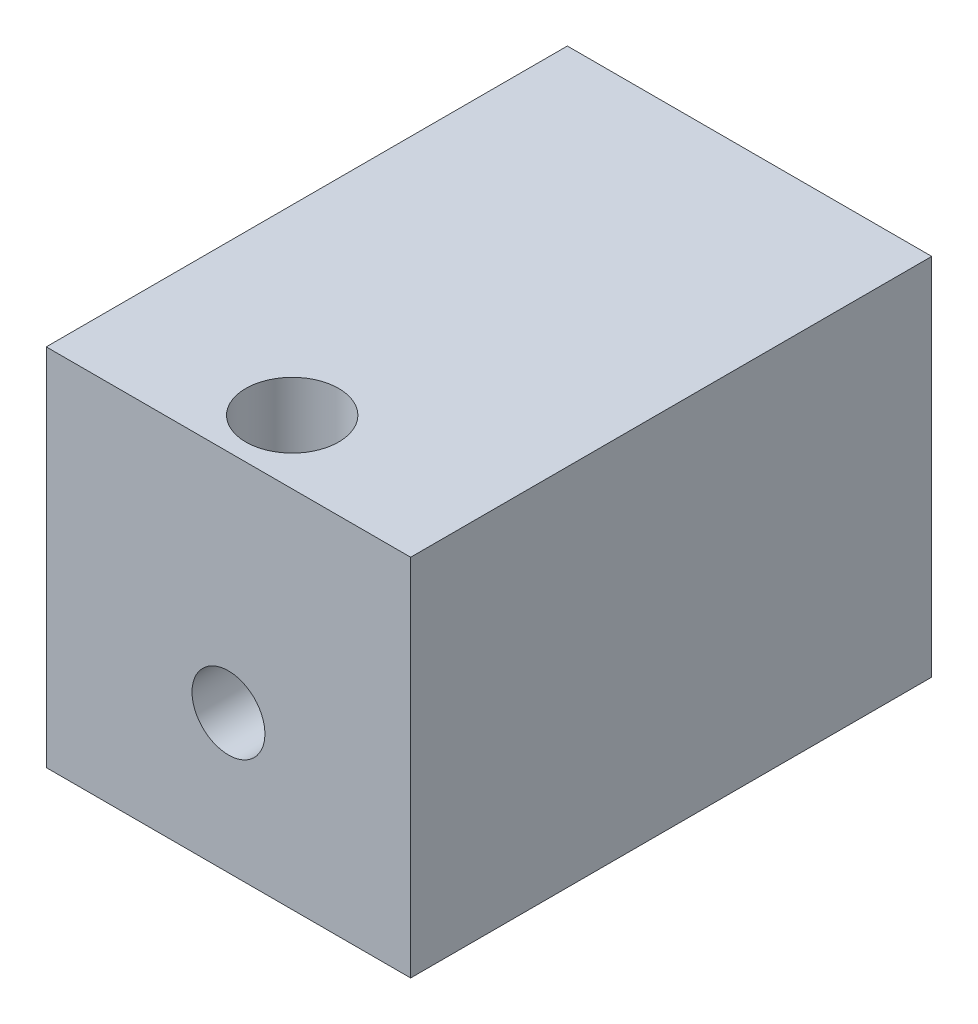
ISO-10303-21;
HEADER;
FILE_DESCRIPTION(('STEP AP214'),'2;1');
FILE_NAME('part.step','',(''),(''),'','','');
FILE_SCHEMA(('AUTOMOTIVE_DESIGN { 1 0 10303 214 1 1 1 1 }'));
ENDSEC;
DATA;
#1=APPLICATION_CONTEXT('core data for automotive mechanical design processes');
#2=APPLICATION_PROTOCOL_DEFINITION('international standard','automotive_design',2000,#1);
#3=PRODUCT_CONTEXT('',#1,'mechanical');
#4=PRODUCT('Part','Part','',(#3));
#5=PRODUCT_RELATED_PRODUCT_CATEGORY('part','',(#4));
#6=PRODUCT_DEFINITION_FORMATION('','',#4);
#7=PRODUCT_DEFINITION_CONTEXT('part definition',#1,'design');
#8=PRODUCT_DEFINITION('design','',#6,#7);
#9=PRODUCT_DEFINITION_SHAPE('','',#8);
#10=(LENGTH_UNIT() NAMED_UNIT(*) SI_UNIT(.MILLI.,.METRE.));
#11=(NAMED_UNIT(*) PLANE_ANGLE_UNIT() SI_UNIT($,.RADIAN.));
#12=(NAMED_UNIT(*) SI_UNIT($,.STERADIAN.) SOLID_ANGLE_UNIT());
#13=UNCERTAINTY_MEASURE_WITH_UNIT(LENGTH_MEASURE(1.E-05),#10,'distance_accuracy_value','');
#14=(GEOMETRIC_REPRESENTATION_CONTEXT(3) GLOBAL_UNCERTAINTY_ASSIGNED_CONTEXT((#13)) GLOBAL_UNIT_ASSIGNED_CONTEXT((#10,
#11,#12)) REPRESENTATION_CONTEXT('',''));
#15=CARTESIAN_POINT('',(0.,0.,0.));
#16=DIRECTION('',(0.,0.,1.));
#17=DIRECTION('',(1.,0.,0.));
#18=AXIS2_PLACEMENT_3D('',#15,#16,#17);
#19=CARTESIAN_POINT('',(0.,20.,0.));
#20=DIRECTION('',(1.,0.,0.));
#21=DIRECTION('',(0.,0.,-1.));
#22=AXIS2_PLACEMENT_3D('',#19,#20,#21);
#23=PLANE('',#22);
#24=DIRECTION('',(0.,0.,1.));
#25=VECTOR('',#24,1.);
#26=CARTESIAN_POINT('',(0.,0.,0.));
#27=LINE('',#26,#25);
#28=CARTESIAN_POINT('',(0.,0.,-28.6));
#29=VERTEX_POINT('',#28);
#30=CARTESIAN_POINT('',(0.,0.,0.));
#31=VERTEX_POINT('',#30);
#32=EDGE_CURVE('E104',#29,#31,#27,.T.);
#33=ORIENTED_EDGE('',*,*,#32,.T.);
#34=DIRECTION('',(0.,-1.,0.));
#35=VECTOR('',#34,1.);
#36=CARTESIAN_POINT('',(0.,20.,0.));
#37=LINE('',#36,#35);
#38=CARTESIAN_POINT('',(0.,20.,0.));
#39=VERTEX_POINT('',#38);
#40=EDGE_CURVE('E11',#39,#31,#37,.T.);
#41=ORIENTED_EDGE('',*,*,#40,.F.);
#42=DIRECTION('',(0.,0.,1.));
#43=VECTOR('',#42,1.);
#44=CARTESIAN_POINT('',(0.,20.,0.));
#45=LINE('',#44,#43);
#46=CARTESIAN_POINT('',(0.,20.,-28.6));
#47=VERTEX_POINT('',#46);
#48=EDGE_CURVE('E91',#47,#39,#45,.T.);
#49=ORIENTED_EDGE('',*,*,#48,.F.);
#50=DIRECTION('',(0.,-1.,0.));
#51=VECTOR('',#50,1.);
#52=CARTESIAN_POINT('',(0.,20.,-28.6));
#53=LINE('',#52,#51);
#54=EDGE_CURVE('E100',#47,#29,#53,.T.);
#55=ORIENTED_EDGE('',*,*,#54,.T.);
#56=EDGE_LOOP('',(#33,#41,#49,#55));
#57=FACE_BOUND('',#56,.T.);
#58=ADVANCED_FACE('F33',(#57),#23,.F.);
#59=CARTESIAN_POINT('',(0.,20.,0.));
#60=DIRECTION('',(0.,0.,-1.));
#61=DIRECTION('',(-1.,0.,0.));
#62=AXIS2_PLACEMENT_3D('',#59,#60,#61);
#63=PLANE('',#62);
#64=CARTESIAN_POINT('',(10.,7.6,0.));
#65=DIRECTION('',(0.,0.,-1.));
#66=DIRECTION('',(-1.,0.,0.));
#67=AXIS2_PLACEMENT_3D('',#64,#65,#66);
#68=CIRCLE('',#67,2.);
#69=CARTESIAN_POINT('',(8.,7.6,0.));
#70=VERTEX_POINT('',#69);
#71=EDGE_CURVE('E117',#70,#70,#68,.F.);
#72=ORIENTED_EDGE('',*,*,#71,.F.);
#73=EDGE_LOOP('',(#72));
#74=FACE_BOUND('',#73,.T.);
#75=DIRECTION('',(1.,0.,0.));
#76=VECTOR('',#75,1.);
#77=CARTESIAN_POINT('',(0.,0.,0.));
#78=LINE('',#77,#76);
#79=CARTESIAN_POINT('',(20.,0.,0.));
#80=VERTEX_POINT('',#79);
#81=EDGE_CURVE('E95',#31,#80,#78,.T.);
#82=ORIENTED_EDGE('',*,*,#81,.T.);
#83=DIRECTION('',(0.,-1.,0.));
#84=VECTOR('',#83,1.);
#85=CARTESIAN_POINT('',(20.,20.,0.));
#86=LINE('',#85,#84);
#87=CARTESIAN_POINT('',(20.,20.,0.));
#88=VERTEX_POINT('',#87);
#89=EDGE_CURVE('E47',#88,#80,#86,.T.);
#90=ORIENTED_EDGE('',*,*,#89,.F.);
#91=DIRECTION('',(1.,0.,0.));
#92=VECTOR('',#91,1.);
#93=CARTESIAN_POINT('',(0.,20.,0.));
#94=LINE('',#93,#92);
#95=EDGE_CURVE('E86',#39,#88,#94,.T.);
#96=ORIENTED_EDGE('',*,*,#95,.F.);
#97=ORIENTED_EDGE('',*,*,#40,.T.);
#98=EDGE_LOOP('',(#82,#90,#96,#97));
#99=FACE_BOUND('',#98,.T.);
#100=ADVANCED_FACE('F94',(#74,#99),#63,.F.);
#101=CARTESIAN_POINT('',(20.,20.,0.));
#102=DIRECTION('',(-1.,0.,0.));
#103=DIRECTION('',(0.,0.,1.));
#104=AXIS2_PLACEMENT_3D('',#101,#102,#103);
#105=PLANE('',#104);
#106=DIRECTION('',(0.,0.,-1.));
#107=VECTOR('',#106,1.);
#108=CARTESIAN_POINT('',(20.,0.,0.));
#109=LINE('',#108,#107);
#110=CARTESIAN_POINT('',(20.,0.,-28.6));
#111=VERTEX_POINT('',#110);
#112=EDGE_CURVE('E73',#80,#111,#109,.T.);
#113=ORIENTED_EDGE('',*,*,#112,.T.);
#114=DIRECTION('',(0.,-1.,0.));
#115=VECTOR('',#114,1.);
#116=CARTESIAN_POINT('',(20.,20.,-28.6));
#117=LINE('',#116,#115);
#118=CARTESIAN_POINT('',(20.,20.,-28.6));
#119=VERTEX_POINT('',#118);
#120=EDGE_CURVE('E96',#119,#111,#117,.T.);
#121=ORIENTED_EDGE('',*,*,#120,.F.);
#122=DIRECTION('',(0.,0.,-1.));
#123=VECTOR('',#122,1.);
#124=CARTESIAN_POINT('',(20.,20.,0.));
#125=LINE('',#124,#123);
#126=EDGE_CURVE('E89',#88,#119,#125,.T.);
#127=ORIENTED_EDGE('',*,*,#126,.F.);
#128=ORIENTED_EDGE('',*,*,#89,.T.);
#129=EDGE_LOOP('',(#113,#121,#127,#128));
#130=FACE_BOUND('',#129,.T.);
#131=ADVANCED_FACE('F98',(#130),#105,.F.);
#132=CARTESIAN_POINT('',(0.,20.,-28.6));
#133=DIRECTION('',(0.,0.,1.));
#134=DIRECTION('',(1.,0.,0.));
#135=AXIS2_PLACEMENT_3D('',#132,#133,#134);
#136=PLANE('',#135);
#137=CARTESIAN_POINT('',(10.,7.6,-28.6));
#138=DIRECTION('',(0.,0.,-1.));
#139=DIRECTION('',(-1.,0.,0.));
#140=AXIS2_PLACEMENT_3D('',#137,#138,#139);
#141=CIRCLE('',#140,2.);
#142=CARTESIAN_POINT('',(8.,7.6,-28.6));
#143=VERTEX_POINT('',#142);
#144=EDGE_CURVE('E206',#143,#143,#141,.T.);
#145=ORIENTED_EDGE('',*,*,#144,.F.);
#146=EDGE_LOOP('',(#145));
#147=FACE_BOUND('',#146,.T.);
#148=DIRECTION('',(-1.,0.,0.));
#149=VECTOR('',#148,1.);
#150=CARTESIAN_POINT('',(0.,0.,-28.6));
#151=LINE('',#150,#149);
#152=EDGE_CURVE('E79',#111,#29,#151,.T.);
#153=ORIENTED_EDGE('',*,*,#152,.T.);
#154=ORIENTED_EDGE('',*,*,#54,.F.);
#155=DIRECTION('',(-1.,0.,0.));
#156=VECTOR('',#155,1.);
#157=CARTESIAN_POINT('',(0.,20.,-28.6));
#158=LINE('',#157,#156);
#159=EDGE_CURVE('E56',#119,#47,#158,.T.);
#160=ORIENTED_EDGE('',*,*,#159,.F.);
#161=ORIENTED_EDGE('',*,*,#120,.T.);
#162=EDGE_LOOP('',(#153,#154,#160,#161));
#163=FACE_BOUND('',#162,.T.);
#164=ADVANCED_FACE('F156',(#147,#163),#136,.F.);
#165=CARTESIAN_POINT('',(0.,20.,0.));
#166=DIRECTION('',(0.,-1.,0.));
#167=DIRECTION('',(0.,0.,-1.));
#168=AXIS2_PLACEMENT_3D('',#165,#166,#167);
#169=PLANE('',#168);
#170=CARTESIAN_POINT('',(10.,20.,-3.5));
#171=DIRECTION('',(0.,1.,0.));
#172=DIRECTION('',(0.,0.,1.));
#173=AXIS2_PLACEMENT_3D('',#170,#171,#172);
#174=CIRCLE('',#173,2.55);
#175=CARTESIAN_POINT('',(10.,20.,-0.95));
#176=VERTEX_POINT('',#175);
#177=EDGE_CURVE('E207',#176,#176,#174,.T.);
#178=ORIENTED_EDGE('',*,*,#177,.F.);
#179=EDGE_LOOP('',(#178));
#180=FACE_BOUND('',#179,.T.);
#181=ORIENTED_EDGE('',*,*,#48,.T.);
#182=ORIENTED_EDGE('',*,*,#95,.T.);
#183=ORIENTED_EDGE('',*,*,#126,.T.);
#184=ORIENTED_EDGE('',*,*,#159,.T.);
#185=EDGE_LOOP('',(#181,#182,#183,#184));
#186=FACE_BOUND('',#185,.T.);
#187=ADVANCED_FACE('F87',(#180,#186),#169,.F.);
#188=CARTESIAN_POINT('',(0.,0.,0.));
#189=DIRECTION('',(0.,-1.,0.));
#190=DIRECTION('',(0.,0.,-1.));
#191=AXIS2_PLACEMENT_3D('',#188,#189,#190);
#192=PLANE('',#191);
#193=CARTESIAN_POINT('',(10.,0.,-18.6));
#194=DIRECTION('',(0.,-1.,0.));
#195=DIRECTION('',(0.,0.,-1.));
#196=AXIS2_PLACEMENT_3D('',#193,#194,#195);
#197=CIRCLE('',#196,7.6);
#198=CARTESIAN_POINT('',(10.,0.,-26.2));
#199=VERTEX_POINT('',#198);
#200=EDGE_CURVE('E217',#199,#199,#197,.T.);
#201=ORIENTED_EDGE('',*,*,#200,.F.);
#202=EDGE_LOOP('',(#201));
#203=FACE_BOUND('',#202,.T.);
#204=ORIENTED_EDGE('',*,*,#32,.F.);
#205=ORIENTED_EDGE('',*,*,#152,.F.);
#206=ORIENTED_EDGE('',*,*,#112,.F.);
#207=ORIENTED_EDGE('',*,*,#81,.F.);
#208=EDGE_LOOP('',(#204,#205,#206,#207));
#209=FACE_BOUND('',#208,.T.);
#210=ADVANCED_FACE('F139',(#203,#209),#192,.T.);
#211=CARTESIAN_POINT('',(10.,13.,-18.6));
#212=DIRECTION('',(0.,-1.,0.));
#213=DIRECTION('',(0.,0.,-1.));
#214=AXIS2_PLACEMENT_3D('',#211,#212,#213);
#215=CYLINDRICAL_SURFACE('',#214,7.6);
#216=CARTESIAN_POINT('',(10.,9.6,-26.2));
#217=CARTESIAN_POINT('',(10.1103077305601,9.59999727332698,-26.1999982871455));
#218=CARTESIAN_POINT('',(10.2206449359856,9.59084353481075,-26.1975747644297));
#219=CARTESIAN_POINT('',(10.4381443376833,9.55453308901949,-26.1881421009162));
#220=CARTESIAN_POINT('',(10.5453049197391,9.52736738732782,-26.1811306691326));
#221=CARTESIAN_POINT('',(10.7532798361747,9.45597473968142,-26.1632966106084));
#222=CARTESIAN_POINT('',(10.8541020443881,9.41176946848747,-26.1524788271606));
#223=CARTESIAN_POINT('',(11.0469012230525,9.30763198314898,-26.1281772122626));
#224=CARTESIAN_POINT('',(11.1388776652486,9.24769883055689,-26.1146932217376));
#225=CARTESIAN_POINT('',(11.3134559490354,9.11237470744187,-26.0861755330927));
#226=CARTESIAN_POINT('',(11.3958290770572,9.03669413794758,-26.0711158938237));
#227=CARTESIAN_POINT('',(11.5468726766925,8.87264275306713,-26.0413120236605));
#228=CARTESIAN_POINT('',(11.6155414326768,8.78427035118859,-26.0265678324628));
#229=CARTESIAN_POINT('',(11.7383336680974,8.59552898529889,-25.9987997288807));
#230=CARTESIAN_POINT('',(11.7921955989454,8.49498459816491,-25.9858085903369));
#231=CARTESIAN_POINT('',(11.8821611802115,8.28587031662128,-25.9633982451214));
#232=CARTESIAN_POINT('',(11.9182680102081,8.17730186316783,-25.9539783989728));
#233=CARTESIAN_POINT('',(11.9709071610783,7.95775045751483,-25.9400447576793));
#234=CARTESIAN_POINT('',(11.9878534209387,7.84687348172334,-25.9354273949558));
#235=CARTESIAN_POINT('',(12.0029806593874,7.62376159546161,-25.9313119612008));
#236=CARTESIAN_POINT('',(12.0011650453797,7.51152693526287,-25.9318129606069));
#237=CARTESIAN_POINT('',(11.979149052759,7.29210381644217,-25.9377848618719));
#238=CARTESIAN_POINT('',(11.9594478952481,7.18486101301021,-25.943120803201));
#239=CARTESIAN_POINT('',(11.9030189360574,6.97525919705931,-25.9579454846944));
#240=CARTESIAN_POINT('',(11.8662898053087,6.8729005664482,-25.9674345490155));
#241=CARTESIAN_POINT('',(11.7764367186874,6.67466337033174,-25.9896160870518));
#242=CARTESIAN_POINT('',(11.7231364253582,6.57886871674745,-26.0023427343597));
#243=CARTESIAN_POINT('',(11.6017770961602,6.39740691268406,-26.0295468982524));
#244=CARTESIAN_POINT('',(11.5337152239016,6.31174171344167,-26.0440247510888));
#245=CARTESIAN_POINT('',(11.3822050171688,6.15011640603573,-26.0736632108534));
#246=CARTESIAN_POINT('',(11.2983370128123,6.07455046241615,-26.088830905761));
#247=CARTESIAN_POINT('',(11.1189344723606,5.93847627648179,-26.1177276126972));
#248=CARTESIAN_POINT('',(11.023399500154,5.87796859730194,-26.1314565709102));
#249=CARTESIAN_POINT('',(10.8227748702699,5.77356125603069,-26.1560097590161));
#250=CARTESIAN_POINT('',(10.7176473149743,5.72973134653084,-26.1668217353776));
#251=CARTESIAN_POINT('',(10.5011668202814,5.66047966896322,-26.1842340731603));
#252=CARTESIAN_POINT('',(10.3898152099559,5.63505398694887,-26.1908353300215));
#253=CARTESIAN_POINT('',(10.167412666022,5.6039477434924,-26.1989476543889));
#254=CARTESIAN_POINT('',(10.0564416383871,5.59773109839775,-26.2005968844482));
#255=CARTESIAN_POINT('',(9.83504313014607,5.60374111690053,-26.1990157568394));
#256=CARTESIAN_POINT('',(9.72461559605388,5.61596592770282,-26.1957858893694));
#257=CARTESIAN_POINT('',(9.50934118766853,5.65807163649291,-26.1848985710053));
#258=CARTESIAN_POINT('',(9.40443198357834,5.68765493602793,-26.1773157939217));
#259=CARTESIAN_POINT('',(9.20107443639967,5.76329349643487,-26.1585815253349));
#260=CARTESIAN_POINT('',(9.10262678520824,5.80935051790303,-26.1474296524051));
#261=CARTESIAN_POINT('',(8.912893115047,5.91763305770661,-26.1224689005433));
#262=CARTESIAN_POINT('',(8.82178092074553,5.98015207165798,-26.1086131120961));
#263=CARTESIAN_POINT('',(8.65115221935879,6.11921362431206,-26.0798468852588));
#264=CARTESIAN_POINT('',(8.5716379458241,6.19575885782469,-26.0649362445421));
#265=CARTESIAN_POINT('',(8.42421384894536,6.36319920856277,-26.0352348380538));
#266=CARTESIAN_POINT('',(8.3566818175648,6.45443013067817,-26.0204585590288));
#267=CARTESIAN_POINT('',(8.2378793817264,6.64724039689845,-25.9931495963007));
#268=CARTESIAN_POINT('',(8.18660828587872,6.74881930078045,-25.9806168172174));
#269=CARTESIAN_POINT('',(8.1021690878029,6.95892498766296,-25.9593569458031));
#270=CARTESIAN_POINT('',(8.06889532457678,7.06740694497724,-25.9506077028033));
#271=CARTESIAN_POINT('',(8.02113851566438,7.28869458185313,-25.9378968052726));
#272=CARTESIAN_POINT('',(8.00665082029314,7.40149918441032,-25.9339339660894));
#273=CARTESIAN_POINT('',(7.99713967530735,7.6243673421597,-25.9313416819152));
#274=CARTESIAN_POINT('',(8.00150977037439,7.73440347625629,-25.93254605516));
#275=CARTESIAN_POINT('',(8.02818743953568,7.95211040335236,-25.9397644582545));
#276=CARTESIAN_POINT('',(8.05049457470362,8.05978125416501,-25.9457783704129));
#277=CARTESIAN_POINT('',(8.11206579077547,8.26896036119323,-25.9618406508767));
#278=CARTESIAN_POINT('',(8.15120454203399,8.3705079608682,-25.9718591624495));
#279=CARTESIAN_POINT('',(8.24523035269886,8.56567133098789,-25.9948032410771));
#280=CARTESIAN_POINT('',(8.30011982271296,8.65928588445697,-26.0077292530521));
#281=CARTESIAN_POINT('',(8.42594055277581,8.83882833006595,-26.0354955313453));
#282=CARTESIAN_POINT('',(8.4972871696406,8.92445833405862,-26.0503801051353));
#283=CARTESIAN_POINT('',(8.65320278090077,9.08272753068859,-26.0801353739938));
#284=CARTESIAN_POINT('',(8.73777496814073,9.15536357729419,-26.0950060648363));
#285=CARTESIAN_POINT('',(8.91985033095893,9.28705619708457,-26.1234254065456));
#286=CARTESIAN_POINT('',(9.01758463455323,9.34580108779218,-26.1369403819044));
#287=CARTESIAN_POINT('',(9.22189289666711,9.44593396047491,-26.1607601280525));
#288=CARTESIAN_POINT('',(9.32846098318305,9.48733336328497,-26.1710670100019));
#289=CARTESIAN_POINT('',(9.52889936277852,9.5460384721217,-26.1859349673448));
#290=CARTESIAN_POINT('',(9.62188531840803,9.56622776042776,-26.1911714000355));
#291=CARTESIAN_POINT('',(9.80990701464762,9.593209074221,-26.1982044939182));
#292=CARTESIAN_POINT('',(9.90494256317135,9.6000023497043,-26.2000014760485));
#293=CARTESIAN_POINT('',(10.,9.6,-26.2));
#294=B_SPLINE_CURVE_WITH_KNOTS('',3,(#216,#217,#218,#219,#220,#221,#222,#223,#224,#225,#226,
#227,#228,#229,#230,#231,#232,#233,#234,#235,#236,#237,#238,#239,#240,#241,#242,#243,#244,#245,
#246,#247,#248,#249,#250,#251,#252,#253,#254,#255,#256,#257,#258,#259,#260,#261,#262,#263,#264,
#265,#266,#267,#268,#269,#270,#271,#272,#273,#274,#275,#276,#277,#278,#279,#280,#281,#282,#283,
#284,#285,#286,#287,#288,#289,#290,#291,#292,#293),.UNSPECIFIED.,.T.,.F.,(4,2,2,2,2,2,2,2,2,2,2,
2,2,2,2,2,2,2,2,2,2,2,2,2,2,2,2,2,2,2,2,2,2,2,2,2,2,2,4),(0.,0.330574645834022,
0.661314491187416,0.991635008125812,1.32197523903445,1.65903413949998,1.99613520941282,
2.33885568494099,2.68151476381289,3.01662056728243,3.3516655121819,3.67763689182931,
4.00363371850887,4.33322568429278,4.66288103630069,5.00299580592632,5.34312329293655,
5.68465807920425,6.02612021140573,6.35796260710344,6.68977166513867,7.01605177441632,
7.34236676465521,7.67494788505055,8.00759297025066,8.34935532098777,8.69110313856946,
9.0308221805077,9.37045712351516,9.69925242300547,10.0280396769924,10.3544200269369,
10.6808503552366,11.0166535224827,11.3525378829913,11.6953641850873,12.0379644030747,
12.3228629404097,12.6077348923025),.UNSPECIFIED.);
#295=CARTESIAN_POINT('',(10.,9.6,-26.2));
#296=VERTEX_POINT('',#295);
#297=EDGE_CURVE('E36',#296,#296,#294,.T.);
#298=ORIENTED_EDGE('',*,*,#297,.T.);
#299=EDGE_LOOP('',(#298));
#300=FACE_BOUND('',#299,.T.);
#301=CARTESIAN_POINT('',(8.,7.6,-11.2678788880707));
#302=CARTESIAN_POINT('',(8.00000276599729,7.48976686204483,-11.2678769277619));
#303=CARTESIAN_POINT('',(8.00914455595565,7.37950417209052,-11.2653658054503));
#304=CARTESIAN_POINT('',(8.04540324746967,7.16215930576434,-11.2556217293923));
#305=CARTESIAN_POINT('',(8.07252947544504,7.05507880974266,-11.2483863257445));
#306=CARTESIAN_POINT('',(8.14380678376653,6.84727381231109,-11.2300686219247));
#307=CARTESIAN_POINT('',(8.1879343504549,6.74654075500005,-11.2189916369454));
#308=CARTESIAN_POINT('',(8.2918884823279,6.55389279127753,-11.1942456101168));
#309=CARTESIAN_POINT('',(8.35171614954339,6.46197850449719,-11.1805763863303));
#310=CARTESIAN_POINT('',(8.48693045113749,6.28733783214917,-11.1518129647462));
#311=CARTESIAN_POINT('',(8.56263044565936,6.20485808683986,-11.1366940321851));
#312=CARTESIAN_POINT('',(8.72676640325725,6.05360650496584,-11.1069484380797));
#313=CARTESIAN_POINT('',(8.81520365644608,5.98483605865276,-11.0923218265862));
#314=CARTESIAN_POINT('',(9.00400952223337,5.8619309121777,-11.0649333919741));
#315=CARTESIAN_POINT('',(9.10454247981947,5.80804078622589,-11.0522041527809));
#316=CARTESIAN_POINT('',(9.31363238438037,5.71802001427478,-11.0303281608539));
#317=CARTESIAN_POINT('',(9.42218801164357,5.68188645480651,-11.0211808204581));
#318=CARTESIAN_POINT('',(9.64166801271143,5.62920097720801,-11.0076741735301));
#319=CARTESIAN_POINT('',(9.75248529948121,5.61222965906612,-11.0032124725273));
#320=CARTESIAN_POINT('',(9.97547792627989,5.59703156285508,-10.9992220646682));
#321=CARTESIAN_POINT('',(10.0876530417424,5.59880172639036,-10.9996925529351));
#322=CARTESIAN_POINT('',(10.3072601393456,5.62073964414333,-11.0054382301699));
#323=CARTESIAN_POINT('',(10.4147409445107,5.64045436494663,-11.0105951003331));
#324=CARTESIAN_POINT('',(10.6248114429376,5.69699067311018,-11.0249948934747));
#325=CARTESIAN_POINT('',(10.7274008606872,5.7338132228334,-11.0342380463164));
#326=CARTESIAN_POINT('',(10.9259409258729,5.82387129175163,-11.0559485177522));
#327=CARTESIAN_POINT('',(11.0218171019436,5.87726332051096,-11.0684463900959));
#328=CARTESIAN_POINT('',(11.2034043819033,5.99882492529181,-11.0953177327139));
#329=CARTESIAN_POINT('',(11.2891135447329,6.06699731613852,-11.109691560044));
#330=CARTESIAN_POINT('',(11.4506374841107,6.21859453806116,-11.1392626326509));
#331=CARTESIAN_POINT('',(11.5260795243472,6.30241467064548,-11.1544716471264));
#332=CARTESIAN_POINT('',(11.6619254149039,6.48167462998135,-11.1836097515704));
#333=CARTESIAN_POINT('',(11.7223283971044,6.57711512703752,-11.1975387676225));
#334=CARTESIAN_POINT('',(11.8266554588071,6.77769816608451,-11.2225859335363));
#335=CARTESIAN_POINT('',(11.8704807429159,6.88289436197515,-11.2336871066159));
#336=CARTESIAN_POINT('',(11.9397030057677,7.09952615203017,-11.2516093681869));
#337=CARTESIAN_POINT('',(11.965104417616,7.21096023829336,-11.2584314862403));
#338=CARTESIAN_POINT('',(11.9961205368333,7.43342496872966,-11.2668045646002));
#339=CARTESIAN_POINT('',(12.0022902019366,7.54437276523676,-11.2685033182077));
#340=CARTESIAN_POINT('',(11.9961946164774,7.76571427955043,-11.2668412423745));
#341=CARTESIAN_POINT('',(11.9839312698173,7.87610805339907,-11.2634809354721));
#342=CARTESIAN_POINT('',(11.9418064548735,8.0910864220551,-11.2522218769591));
#343=CARTESIAN_POINT('',(11.9122763163379,8.19574085330529,-11.2444086414912));
#344=CARTESIAN_POINT('',(11.8368275902683,8.39861200679714,-11.2252071167487));
#345=CARTESIAN_POINT('',(11.7909069043202,8.49682790283313,-11.2138183697385));
#346=CARTESIAN_POINT('',(11.6828464547579,8.68636220523739,-11.1884440161008));
#347=CARTESIAN_POINT('',(11.6203795301077,8.77748716683072,-11.1744078891186));
#348=CARTESIAN_POINT('',(11.481407091613,8.94816517560008,-11.1454402382792));
#349=CARTESIAN_POINT('',(11.404899010369,9.02771610170838,-11.1305085510073));
#350=CARTESIAN_POINT('',(11.237453414162,9.1752795702748,-11.1009251044835));
#351=CARTESIAN_POINT('',(11.1461712877549,9.24290577142079,-11.0862929524013));
#352=CARTESIAN_POINT('',(10.9532275957223,9.36187385850744,-11.0593879221094));
#353=CARTESIAN_POINT('',(10.8515665819947,9.41321660972566,-11.0471149185519));
#354=CARTESIAN_POINT('',(10.6414653330975,9.49769385577293,-11.0263898988743));
#355=CARTESIAN_POINT('',(10.5330823442985,9.53096345858921,-11.017909616621));
#356=CARTESIAN_POINT('',(10.3120082493634,9.57874521229605,-11.0056012671082));
#357=CARTESIAN_POINT('',(10.1993180765336,9.59326140332881,-11.001772197825));
#358=CARTESIAN_POINT('',(9.97644209026249,9.60287668580068,-10.9992436446291));
#359=CARTESIAN_POINT('',(9.86628210622963,9.59854321146786,-11.000394251461));
#360=CARTESIAN_POINT('',(9.64831744930803,9.5718958585314,-11.0073581725923));
#361=CARTESIAN_POINT('',(9.54051269221903,9.5495826237949,-11.0131713199229));
#362=CARTESIAN_POINT('',(9.33098221809817,9.48792655926167,-11.0287787860009));
#363=CARTESIAN_POINT('',(9.22922132201749,9.44869618024169,-11.0385467904738));
#364=CARTESIAN_POINT('',(9.03366809158366,9.35442008374477,-11.0610410689179));
#365=CARTESIAN_POINT('',(8.9398768540588,9.29937219392802,-11.0737677491809));
#366=CARTESIAN_POINT('',(8.76027291813472,9.17334791536646,-11.1012299259677));
#367=CARTESIAN_POINT('',(8.67473225233634,9.10199339216637,-11.1160091727351));
#368=CARTESIAN_POINT('',(8.51664678628682,8.94610216396534,-11.1457296063981));
#369=CARTESIAN_POINT('',(8.44410538308487,8.86156202398013,-11.1606708345449));
#370=CARTESIAN_POINT('',(8.31255350925241,8.67953686352619,-11.1893883929816));
#371=CARTESIAN_POINT('',(8.2538634644355,8.58181486266655,-11.2031332075032));
#372=CARTESIAN_POINT('',(8.15383003485241,8.37754127679878,-11.2274614565022));
#373=CARTESIAN_POINT('',(8.11247502460715,8.27099566682022,-11.2380470083149));
#374=CARTESIAN_POINT('',(8.05386082277979,8.0706640927411,-11.2533482632721));
#375=CARTESIAN_POINT('',(8.03370968835963,7.97776684445389,-11.2587538384778));
#376=CARTESIAN_POINT('',(8.00677880290714,7.78992022835784,-11.2660198051062));
#377=CARTESIAN_POINT('',(7.99999761696201,7.69497108187227,-11.2678805769697));
#378=CARTESIAN_POINT('',(8.,7.6,-11.2678788880707));
#379=B_SPLINE_CURVE_WITH_KNOTS('',3,(#301,#302,#303,#304,#305,#306,#307,#308,#309,#310,#311,
#312,#313,#314,#315,#316,#317,#318,#319,#320,#321,#322,#323,#324,#325,#326,#327,#328,#329,#330,
#331,#332,#333,#334,#335,#336,#337,#338,#339,#340,#341,#342,#343,#344,#345,#346,#347,#348,#349,
#350,#351,#352,#353,#354,#355,#356,#357,#358,#359,#360,#361,#362,#363,#364,#365,#366,#367,#368,
#369,#370,#371,#372,#373,#374,#375,#376,#377,#378),.UNSPECIFIED.,.T.,.F.,(4,2,2,2,2,2,2,2,2,2,2,
2,2,2,2,2,2,2,2,2,2,2,2,2,2,2,2,2,2,2,2,2,2,2,2,2,2,2,4),(0.,0.330350291685533,
0.660872031480874,0.990938275561917,1.32102769404999,1.65837957658723,1.99576565238902,
2.33840531149922,2.68098873205666,3.01591922945471,3.35079507086677,3.67744417248705,
4.00411165125322,4.33396379567162,4.66387881358162,5.00366420548206,5.34346920672635,
5.68526852595379,6.02698557499102,6.35874606235034,6.69047228530582,7.01603277243981,
7.34163495469677,7.67423021730903,8.00688635504819,8.3488755510372,8.69084657119868,
9.03022467852337,9.36952965970964,9.69869233828186,10.0278432298441,10.3548391400956,
10.6818799806801,11.0174540773321,11.3531157408405,11.695912972778,12.0384799436987,
12.3231229545963,12.6077354148798),.UNSPECIFIED.);
#380=CARTESIAN_POINT('',(8.,7.6,-11.2678788880707));
#381=VERTEX_POINT('',#380);
#382=EDGE_CURVE('E112',#381,#381,#379,.T.);
#383=ORIENTED_EDGE('',*,*,#382,.T.);
#384=EDGE_LOOP('',(#383));
#385=FACE_BOUND('',#384,.T.);
#386=CARTESIAN_POINT('',(10.,13.,-18.6));
#387=DIRECTION('',(0.,-1.,0.));
#388=DIRECTION('',(0.,0.,-1.));
#389=AXIS2_PLACEMENT_3D('',#386,#387,#388);
#390=CIRCLE('',#389,7.6);
#391=CARTESIAN_POINT('',(10.,13.,-26.2));
#392=VERTEX_POINT('',#391);
#393=EDGE_CURVE('E107',#392,#392,#390,.T.);
#394=ORIENTED_EDGE('',*,*,#393,.F.);
#395=EDGE_LOOP('',(#394));
#396=FACE_BOUND('',#395,.T.);
#397=ORIENTED_EDGE('',*,*,#200,.T.);
#398=EDGE_LOOP('',(#397));
#399=FACE_BOUND('',#398,.T.);
#400=ADVANCED_FACE('F118',(#300,#385,#396,#399),#215,.F.);
#401=CARTESIAN_POINT('',(10.,13.,-18.6));
#402=DIRECTION('',(0.,-1.,0.));
#403=DIRECTION('',(0.,0.,-1.));
#404=AXIS2_PLACEMENT_3D('',#401,#402,#403);
#405=PLANE('',#404);
#406=ORIENTED_EDGE('',*,*,#393,.T.);
#407=EDGE_LOOP('',(#406));
#408=FACE_BOUND('',#407,.T.);
#409=ADVANCED_FACE('F130',(#408),#405,.T.);
#410=CARTESIAN_POINT('',(10.,7.6,5.65685424949237));
#411=DIRECTION('',(0.,0.,-1.));
#412=DIRECTION('',(-1.,0.,0.));
#413=AXIS2_PLACEMENT_3D('',#410,#411,#412);
#414=CYLINDRICAL_SURFACE('',#413,2.);
#415=ORIENTED_EDGE('',*,*,#71,.T.);
#416=EDGE_LOOP('',(#415));
#417=FACE_BOUND('',#416,.T.);
#418=ORIENTED_EDGE('',*,*,#382,.F.);
#419=EDGE_LOOP('',(#418));
#420=FACE_BOUND('',#419,.T.);
#421=ADVANCED_FACE('F127',(#417,#420),#414,.F.);
#422=ORIENTED_EDGE('',*,*,#144,.T.);
#423=EDGE_LOOP('',(#422));
#424=FACE_BOUND('',#423,.T.);
#425=ORIENTED_EDGE('',*,*,#297,.F.);
#426=EDGE_LOOP('',(#425));
#427=FACE_BOUND('',#426,.T.);
#428=ADVANCED_FACE('F122',(#424,#427),#414,.F.);
#429=CARTESIAN_POINT('',(10.,12.,-3.5));
#430=DIRECTION('',(0.,1.,0.));
#431=DIRECTION('',(0.,0.,1.));
#432=AXIS2_PLACEMENT_3D('',#429,#430,#431);
#433=CYLINDRICAL_SURFACE('',#432,2.55);
#434=CARTESIAN_POINT('',(10.,12.,-3.5));
#435=DIRECTION('',(0.,1.,0.));
#436=DIRECTION('',(0.,0.,1.));
#437=AXIS2_PLACEMENT_3D('',#434,#435,#436);
#438=CIRCLE('',#437,2.55);
#439=CARTESIAN_POINT('',(10.,12.,-0.95));
#440=VERTEX_POINT('',#439);
#441=EDGE_CURVE('E205',#440,#440,#438,.T.);
#442=ORIENTED_EDGE('',*,*,#441,.F.);
#443=EDGE_LOOP('',(#442));
#444=FACE_BOUND('',#443,.T.);
#445=ORIENTED_EDGE('',*,*,#177,.T.);
#446=EDGE_LOOP('',(#445));
#447=FACE_BOUND('',#446,.T.);
#448=ADVANCED_FACE('F126',(#444,#447),#433,.F.);
#449=CARTESIAN_POINT('',(10.,12.,-3.5));
#450=DIRECTION('',(0.,1.,0.));
#451=DIRECTION('',(0.,0.,1.));
#452=AXIS2_PLACEMENT_3D('',#449,#450,#451);
#453=PLANE('',#452);
#454=ORIENTED_EDGE('',*,*,#441,.T.);
#455=EDGE_LOOP('',(#454));
#456=FACE_BOUND('',#455,.T.);
#457=ADVANCED_FACE('F191',(#456),#453,.T.);
#458=CLOSED_SHELL('',(#58,#100,#131,#164,#187,#210,#400,#409,#421,#428,#448,#457));
#459=MANIFOLD_SOLID_BREP('B2',#458);
#460=ADVANCED_BREP_SHAPE_REPRESENTATION('',(#18,#459),#14);
#461=SHAPE_DEFINITION_REPRESENTATION(#9,#460);
ENDSEC;
END-ISO-10303-21;
